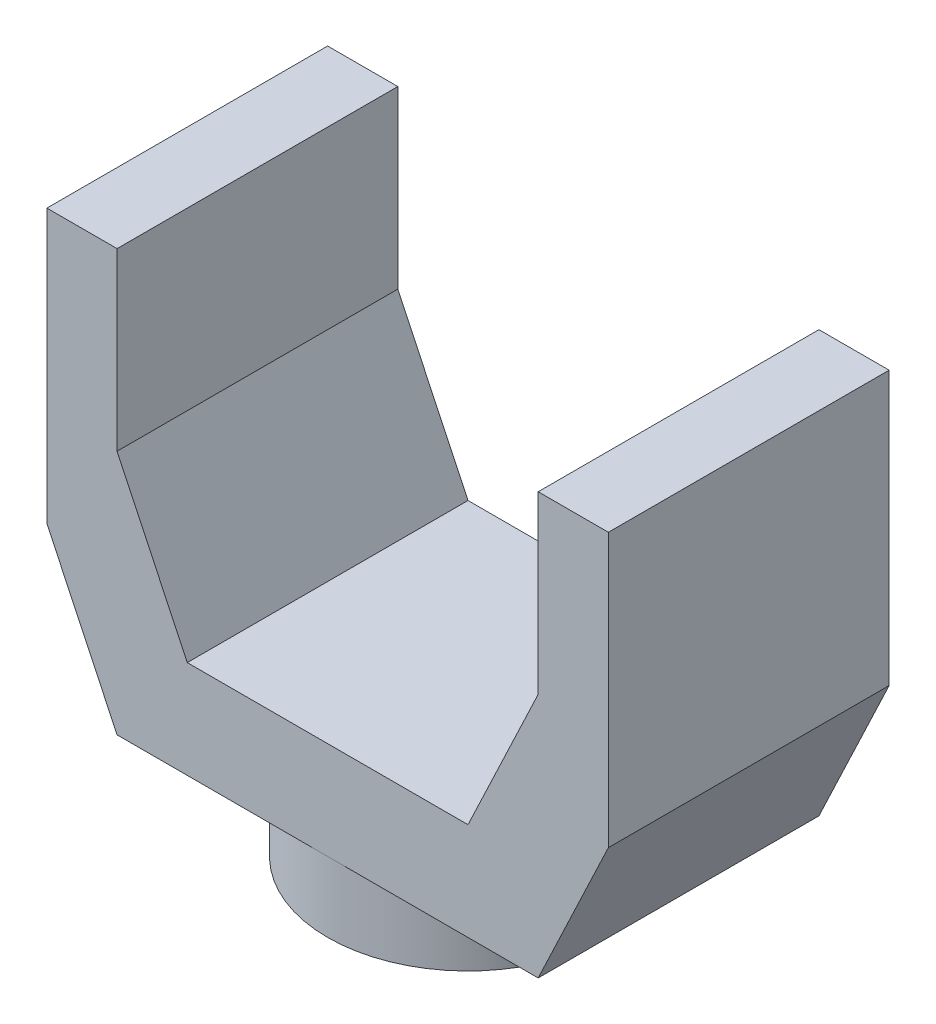
ISO-10303-21;
HEADER;
FILE_DESCRIPTION(('STEP AP214'),'2;1');
FILE_NAME('part.step','',(''),(''),'','','');
FILE_SCHEMA(('AUTOMOTIVE_DESIGN { 1 0 10303 214 1 1 1 1 }'));
ENDSEC;
DATA;
#1=APPLICATION_CONTEXT('core data for automotive mechanical design processes');
#2=APPLICATION_PROTOCOL_DEFINITION('international standard','automotive_design',2000,#1);
#3=PRODUCT_CONTEXT('',#1,'mechanical');
#4=PRODUCT('Part','Part','',(#3));
#5=PRODUCT_RELATED_PRODUCT_CATEGORY('part','',(#4));
#6=PRODUCT_DEFINITION_FORMATION('','',#4);
#7=PRODUCT_DEFINITION_CONTEXT('part definition',#1,'design');
#8=PRODUCT_DEFINITION('design','',#6,#7);
#9=PRODUCT_DEFINITION_SHAPE('','',#8);
#10=(LENGTH_UNIT() NAMED_UNIT(*) SI_UNIT(.MILLI.,.METRE.));
#11=(NAMED_UNIT(*) PLANE_ANGLE_UNIT() SI_UNIT($,.RADIAN.));
#12=(NAMED_UNIT(*) SI_UNIT($,.STERADIAN.) SOLID_ANGLE_UNIT());
#13=UNCERTAINTY_MEASURE_WITH_UNIT(LENGTH_MEASURE(1.E-05),#10,'distance_accuracy_value','');
#14=(GEOMETRIC_REPRESENTATION_CONTEXT(3) GLOBAL_UNCERTAINTY_ASSIGNED_CONTEXT((#13)) GLOBAL_UNIT_ASSIGNED_CONTEXT((#10,
#11,#12)) REPRESENTATION_CONTEXT('',''));
#15=CARTESIAN_POINT('',(0.,0.,0.));
#16=DIRECTION('',(0.,0.,1.));
#17=DIRECTION('',(1.,0.,0.));
#18=AXIS2_PLACEMENT_3D('',#15,#16,#17);
#19=CARTESIAN_POINT('',(-38.1,0.,25.4));
#20=DIRECTION('',(0.,1.,0.));
#21=DIRECTION('',(0.,0.,1.));
#22=AXIS2_PLACEMENT_3D('',#19,#20,#21);
#23=PLANE('',#22);
#24=CARTESIAN_POINT('',(0.,0.,0.));
#25=DIRECTION('',(0.,-1.,0.));
#26=DIRECTION('',(0.,0.,-1.));
#27=AXIS2_PLACEMENT_3D('',#24,#25,#26);
#28=CIRCLE('',#27,25.4);
#29=CARTESIAN_POINT('',(0.,0.,-25.4));
#30=VERTEX_POINT('',#29);
#31=CARTESIAN_POINT('',(0.,0.,25.4));
#32=VERTEX_POINT('',#31);
#33=EDGE_CURVE('E42',#30,#32,#28,.T.);
#34=ORIENTED_EDGE('',*,*,#33,.F.);
#35=DIRECTION('',(1.,0.,0.));
#36=VECTOR('',#35,1.);
#37=CARTESIAN_POINT('',(-38.1,0.,-25.4));
#38=LINE('',#37,#36);
#39=CARTESIAN_POINT('',(38.1,0.,-25.4));
#40=VERTEX_POINT('',#39);
#41=EDGE_CURVE('E101',#30,#40,#38,.T.);
#42=ORIENTED_EDGE('',*,*,#41,.T.);
#43=DIRECTION('',(0.,0.,-1.));
#44=VECTOR('',#43,1.);
#45=CARTESIAN_POINT('',(38.1,0.,25.4));
#46=LINE('',#45,#44);
#47=CARTESIAN_POINT('',(38.1,0.,25.4));
#48=VERTEX_POINT('',#47);
#49=EDGE_CURVE('E165',#48,#40,#46,.T.);
#50=ORIENTED_EDGE('',*,*,#49,.F.);
#51=DIRECTION('',(1.,0.,0.));
#52=VECTOR('',#51,1.);
#53=CARTESIAN_POINT('',(-38.1,0.,25.4));
#54=LINE('',#53,#52);
#55=EDGE_CURVE('E55',#32,#48,#54,.T.);
#56=ORIENTED_EDGE('',*,*,#55,.F.);
#57=EDGE_LOOP('',(#34,#42,#50,#56));
#58=FACE_BOUND('',#57,.T.);
#59=ADVANCED_FACE('F32',(#58),#23,.F.);
#60=CARTESIAN_POINT('',(38.1,0.,25.4));
#61=DIRECTION('',(-0.903507902905251,0.428571428571429,0.));
#62=DIRECTION('',(-0.428571428571429,-0.903507902905251,0.));
#63=AXIS2_PLACEMENT_3D('',#60,#61,#62);
#64=PLANE('',#63);
#65=DIRECTION('',(0.428571428571429,0.903507902905251,0.));
#66=VECTOR('',#65,1.);
#67=CARTESIAN_POINT('',(38.1,0.,-25.4));
#68=LINE('',#67,#66);
#69=CARTESIAN_POINT('',(50.8,26.7739508560923,-25.4));
#70=VERTEX_POINT('',#69);
#71=EDGE_CURVE('E166',#40,#70,#68,.T.);
#72=ORIENTED_EDGE('',*,*,#71,.T.);
#73=DIRECTION('',(0.,0.,-1.));
#74=VECTOR('',#73,1.);
#75=CARTESIAN_POINT('',(50.8,26.7739508560923,25.4));
#76=LINE('',#75,#74);
#77=CARTESIAN_POINT('',(50.8,26.7739508560923,25.4));
#78=VERTEX_POINT('',#77);
#79=EDGE_CURVE('E36',#78,#70,#76,.T.);
#80=ORIENTED_EDGE('',*,*,#79,.F.);
#81=DIRECTION('',(0.428571428571429,0.903507902905251,0.));
#82=VECTOR('',#81,1.);
#83=CARTESIAN_POINT('',(38.1,0.,25.4));
#84=LINE('',#83,#82);
#85=EDGE_CURVE('E191',#48,#78,#84,.T.);
#86=ORIENTED_EDGE('',*,*,#85,.F.);
#87=ORIENTED_EDGE('',*,*,#49,.T.);
#88=EDGE_LOOP('',(#72,#80,#86,#87));
#89=FACE_BOUND('',#88,.T.);
#90=ADVANCED_FACE('F34',(#89),#64,.F.);
#91=CARTESIAN_POINT('',(50.8,26.7739508560923,25.4));
#92=DIRECTION('',(-1.,0.,0.));
#93=DIRECTION('',(0.,0.,1.));
#94=AXIS2_PLACEMENT_3D('',#91,#92,#93);
#95=PLANE('',#94);
#96=DIRECTION('',(0.,1.,0.));
#97=VECTOR('',#96,1.);
#98=CARTESIAN_POINT('',(50.8,26.7739508560923,-25.4));
#99=LINE('',#98,#97);
#100=CARTESIAN_POINT('',(50.8,76.2,-25.4));
#101=VERTEX_POINT('',#100);
#102=EDGE_CURVE('E169',#70,#101,#99,.T.);
#103=ORIENTED_EDGE('',*,*,#102,.T.);
#104=DIRECTION('',(0.,0.,-1.));
#105=VECTOR('',#104,1.);
#106=CARTESIAN_POINT('',(50.8,76.2,25.4));
#107=LINE('',#106,#105);
#108=CARTESIAN_POINT('',(50.8,76.2,25.4));
#109=VERTEX_POINT('',#108);
#110=EDGE_CURVE('E212',#109,#101,#107,.T.);
#111=ORIENTED_EDGE('',*,*,#110,.F.);
#112=DIRECTION('',(0.,1.,0.));
#113=VECTOR('',#112,1.);
#114=CARTESIAN_POINT('',(50.8,26.7739508560923,25.4));
#115=LINE('',#114,#113);
#116=EDGE_CURVE('E110',#78,#109,#115,.T.);
#117=ORIENTED_EDGE('',*,*,#116,.F.);
#118=ORIENTED_EDGE('',*,*,#79,.T.);
#119=EDGE_LOOP('',(#103,#111,#117,#118));
#120=FACE_BOUND('',#119,.T.);
#121=ADVANCED_FACE('F218',(#120),#95,.F.);
#122=CARTESIAN_POINT('',(50.8,76.2,25.4));
#123=DIRECTION('',(0.,-1.,0.));
#124=DIRECTION('',(0.,0.,-1.));
#125=AXIS2_PLACEMENT_3D('',#122,#123,#124);
#126=PLANE('',#125);
#127=DIRECTION('',(-1.,0.,0.));
#128=VECTOR('',#127,1.);
#129=CARTESIAN_POINT('',(50.8,76.2,-25.4));
#130=LINE('',#129,#128);
#131=CARTESIAN_POINT('',(38.1,76.2,-25.4));
#132=VERTEX_POINT('',#131);
#133=EDGE_CURVE('E172',#101,#132,#130,.T.);
#134=ORIENTED_EDGE('',*,*,#133,.T.);
#135=DIRECTION('',(0.,0.,-1.));
#136=VECTOR('',#135,1.);
#137=CARTESIAN_POINT('',(38.1,76.2,25.4));
#138=LINE('',#137,#136);
#139=CARTESIAN_POINT('',(38.1,76.2,25.4));
#140=VERTEX_POINT('',#139);
#141=EDGE_CURVE('E210',#140,#132,#138,.T.);
#142=ORIENTED_EDGE('',*,*,#141,.F.);
#143=DIRECTION('',(-1.,0.,0.));
#144=VECTOR('',#143,1.);
#145=CARTESIAN_POINT('',(50.8,76.2,25.4));
#146=LINE('',#145,#144);
#147=EDGE_CURVE('E236',#109,#140,#146,.T.);
#148=ORIENTED_EDGE('',*,*,#147,.F.);
#149=ORIENTED_EDGE('',*,*,#110,.T.);
#150=EDGE_LOOP('',(#134,#142,#148,#149));
#151=FACE_BOUND('',#150,.T.);
#152=ADVANCED_FACE('F228',(#151),#126,.F.);
#153=CARTESIAN_POINT('',(38.1,76.2,25.4));
#154=DIRECTION('',(1.,0.,0.));
#155=DIRECTION('',(0.,0.,-1.));
#156=AXIS2_PLACEMENT_3D('',#153,#154,#155);
#157=PLANE('',#156);
#158=DIRECTION('',(0.,-1.,0.));
#159=VECTOR('',#158,1.);
#160=CARTESIAN_POINT('',(38.1,76.2,-25.4));
#161=LINE('',#160,#159);
#162=CARTESIAN_POINT('',(38.1,44.45,-25.4));
#163=VERTEX_POINT('',#162);
#164=EDGE_CURVE('E174',#132,#163,#161,.T.);
#165=ORIENTED_EDGE('',*,*,#164,.T.);
#166=DIRECTION('',(0.,0.,-1.));
#167=VECTOR('',#166,1.);
#168=CARTESIAN_POINT('',(38.1,44.45,25.4));
#169=LINE('',#168,#167);
#170=CARTESIAN_POINT('',(38.1,44.45,25.4));
#171=VERTEX_POINT('',#170);
#172=EDGE_CURVE('E207',#171,#163,#169,.T.);
#173=ORIENTED_EDGE('',*,*,#172,.F.);
#174=DIRECTION('',(0.,-1.,0.));
#175=VECTOR('',#174,1.);
#176=CARTESIAN_POINT('',(38.1,76.2,25.4));
#177=LINE('',#176,#175);
#178=EDGE_CURVE('E233',#140,#171,#177,.T.);
#179=ORIENTED_EDGE('',*,*,#178,.F.);
#180=ORIENTED_EDGE('',*,*,#141,.T.);
#181=EDGE_LOOP('',(#165,#173,#179,#180));
#182=FACE_BOUND('',#181,.T.);
#183=ADVANCED_FACE('F231',(#182),#157,.F.);
#184=CARTESIAN_POINT('',(38.1,44.45,25.4));
#185=DIRECTION('',(0.903507902905251,-0.428571428571428,0.));
#186=DIRECTION('',(0.428571428571428,0.903507902905251,0.));
#187=AXIS2_PLACEMENT_3D('',#184,#185,#186);
#188=PLANE('',#187);
#189=DIRECTION('',(-0.428571428571428,-0.903507902905251,0.));
#190=VECTOR('',#189,1.);
#191=CARTESIAN_POINT('',(38.1,44.45,-25.4));
#192=LINE('',#191,#190);
#193=CARTESIAN_POINT('',(25.4,17.6760491439077,-25.4));
#194=VERTEX_POINT('',#193);
#195=EDGE_CURVE('E176',#163,#194,#192,.T.);
#196=ORIENTED_EDGE('',*,*,#195,.T.);
#197=DIRECTION('',(0.,0.,-1.));
#198=VECTOR('',#197,1.);
#199=CARTESIAN_POINT('',(25.4,17.6760491439077,25.4));
#200=LINE('',#199,#198);
#201=CARTESIAN_POINT('',(25.4,17.6760491439077,25.4));
#202=VERTEX_POINT('',#201);
#203=EDGE_CURVE('E204',#202,#194,#200,.T.);
#204=ORIENTED_EDGE('',*,*,#203,.F.);
#205=DIRECTION('',(-0.428571428571428,-0.903507902905251,0.));
#206=VECTOR('',#205,1.);
#207=CARTESIAN_POINT('',(38.1,44.45,25.4));
#208=LINE('',#207,#206);
#209=EDGE_CURVE('E235',#171,#202,#208,.T.);
#210=ORIENTED_EDGE('',*,*,#209,.F.);
#211=ORIENTED_EDGE('',*,*,#172,.T.);
#212=EDGE_LOOP('',(#196,#204,#210,#211));
#213=FACE_BOUND('',#212,.T.);
#214=ADVANCED_FACE('F304',(#213),#188,.F.);
#215=CARTESIAN_POINT('',(25.4,17.6760491439077,25.4));
#216=DIRECTION('',(0.,-1.,0.));
#217=DIRECTION('',(0.,0.,-1.));
#218=AXIS2_PLACEMENT_3D('',#215,#216,#217);
#219=PLANE('',#218);
#220=DIRECTION('',(-1.,0.,0.));
#221=VECTOR('',#220,1.);
#222=CARTESIAN_POINT('',(25.4,17.6760491439077,-25.4));
#223=LINE('',#222,#221);
#224=CARTESIAN_POINT('',(-25.4,17.6760491439077,-25.4));
#225=VERTEX_POINT('',#224);
#226=EDGE_CURVE('E178',#194,#225,#223,.T.);
#227=ORIENTED_EDGE('',*,*,#226,.T.);
#228=DIRECTION('',(0.,0.,-1.));
#229=VECTOR('',#228,1.);
#230=CARTESIAN_POINT('',(-25.4,17.6760491439077,25.4));
#231=LINE('',#230,#229);
#232=CARTESIAN_POINT('',(-25.4,17.6760491439077,25.4));
#233=VERTEX_POINT('',#232);
#234=EDGE_CURVE('E201',#233,#225,#231,.T.);
#235=ORIENTED_EDGE('',*,*,#234,.F.);
#236=DIRECTION('',(-1.,0.,0.));
#237=VECTOR('',#236,1.);
#238=CARTESIAN_POINT('',(25.4,17.6760491439077,25.4));
#239=LINE('',#238,#237);
#240=EDGE_CURVE('E238',#202,#233,#239,.T.);
#241=ORIENTED_EDGE('',*,*,#240,.F.);
#242=ORIENTED_EDGE('',*,*,#203,.T.);
#243=EDGE_LOOP('',(#227,#235,#241,#242));
#244=FACE_BOUND('',#243,.T.);
#245=ADVANCED_FACE('F300',(#244),#219,.F.);
#246=CARTESIAN_POINT('',(-38.1,44.45,25.4));
#247=DIRECTION('',(-0.903507902905251,-0.428571428571428,0.));
#248=DIRECTION('',(0.428571428571428,-0.903507902905251,0.));
#249=AXIS2_PLACEMENT_3D('',#246,#247,#248);
#250=PLANE('',#249);
#251=DIRECTION('',(-0.428571428571428,0.903507902905251,0.));
#252=VECTOR('',#251,1.);
#253=CARTESIAN_POINT('',(-38.1,44.45,-25.4));
#254=LINE('',#253,#252);
#255=CARTESIAN_POINT('',(-38.1,44.45,-25.4));
#256=VERTEX_POINT('',#255);
#257=EDGE_CURVE('E180',#225,#256,#254,.T.);
#258=ORIENTED_EDGE('',*,*,#257,.T.);
#259=DIRECTION('',(0.,0.,-1.));
#260=VECTOR('',#259,1.);
#261=CARTESIAN_POINT('',(-38.1,44.45,25.4));
#262=LINE('',#261,#260);
#263=CARTESIAN_POINT('',(-38.1,44.45,25.4));
#264=VERTEX_POINT('',#263);
#265=EDGE_CURVE('E198',#264,#256,#262,.T.);
#266=ORIENTED_EDGE('',*,*,#265,.F.);
#267=DIRECTION('',(-0.428571428571428,0.903507902905251,0.));
#268=VECTOR('',#267,1.);
#269=CARTESIAN_POINT('',(-38.1,44.45,25.4));
#270=LINE('',#269,#268);
#271=EDGE_CURVE('E244',#233,#264,#270,.T.);
#272=ORIENTED_EDGE('',*,*,#271,.F.);
#273=ORIENTED_EDGE('',*,*,#234,.T.);
#274=EDGE_LOOP('',(#258,#266,#272,#273));
#275=FACE_BOUND('',#274,.T.);
#276=ADVANCED_FACE('F297',(#275),#250,.F.);
#277=CARTESIAN_POINT('',(-38.1,76.2,25.4));
#278=DIRECTION('',(-1.,0.,0.));
#279=DIRECTION('',(0.,0.,1.));
#280=AXIS2_PLACEMENT_3D('',#277,#278,#279);
#281=PLANE('',#280);
#282=DIRECTION('',(0.,1.,0.));
#283=VECTOR('',#282,1.);
#284=CARTESIAN_POINT('',(-38.1,76.2,-25.4));
#285=LINE('',#284,#283);
#286=CARTESIAN_POINT('',(-38.1,76.2,-25.4));
#287=VERTEX_POINT('',#286);
#288=EDGE_CURVE('E182',#256,#287,#285,.T.);
#289=ORIENTED_EDGE('',*,*,#288,.T.);
#290=DIRECTION('',(0.,0.,-1.));
#291=VECTOR('',#290,1.);
#292=CARTESIAN_POINT('',(-38.1,76.2,25.4));
#293=LINE('',#292,#291);
#294=CARTESIAN_POINT('',(-38.1,76.2,25.4));
#295=VERTEX_POINT('',#294);
#296=EDGE_CURVE('E195',#295,#287,#293,.T.);
#297=ORIENTED_EDGE('',*,*,#296,.F.);
#298=DIRECTION('',(0.,1.,0.));
#299=VECTOR('',#298,1.);
#300=CARTESIAN_POINT('',(-38.1,76.2,25.4));
#301=LINE('',#300,#299);
#302=EDGE_CURVE('E246',#264,#295,#301,.T.);
#303=ORIENTED_EDGE('',*,*,#302,.F.);
#304=ORIENTED_EDGE('',*,*,#265,.T.);
#305=EDGE_LOOP('',(#289,#297,#303,#304));
#306=FACE_BOUND('',#305,.T.);
#307=ADVANCED_FACE('F252',(#306),#281,.F.);
#308=CARTESIAN_POINT('',(-50.8,76.2,25.4));
#309=DIRECTION('',(0.,-1.,0.));
#310=DIRECTION('',(0.,0.,-1.));
#311=AXIS2_PLACEMENT_3D('',#308,#309,#310);
#312=PLANE('',#311);
#313=DIRECTION('',(-1.,0.,0.));
#314=VECTOR('',#313,1.);
#315=CARTESIAN_POINT('',(-50.8,76.2,-25.4));
#316=LINE('',#315,#314);
#317=CARTESIAN_POINT('',(-50.8,76.2,-25.4));
#318=VERTEX_POINT('',#317);
#319=EDGE_CURVE('E184',#287,#318,#316,.T.);
#320=ORIENTED_EDGE('',*,*,#319,.T.);
#321=DIRECTION('',(0.,0.,-1.));
#322=VECTOR('',#321,1.);
#323=CARTESIAN_POINT('',(-50.8,76.2,25.4));
#324=LINE('',#323,#322);
#325=CARTESIAN_POINT('',(-50.8,76.2,25.4));
#326=VERTEX_POINT('',#325);
#327=EDGE_CURVE('E155',#326,#318,#324,.T.);
#328=ORIENTED_EDGE('',*,*,#327,.F.);
#329=DIRECTION('',(-1.,0.,0.));
#330=VECTOR('',#329,1.);
#331=CARTESIAN_POINT('',(-50.8,76.2,25.4));
#332=LINE('',#331,#330);
#333=EDGE_CURVE('E143',#295,#326,#332,.T.);
#334=ORIENTED_EDGE('',*,*,#333,.F.);
#335=ORIENTED_EDGE('',*,*,#296,.T.);
#336=EDGE_LOOP('',(#320,#328,#334,#335));
#337=FACE_BOUND('',#336,.T.);
#338=ADVANCED_FACE('F256',(#337),#312,.F.);
#339=CARTESIAN_POINT('',(-50.8,26.7739508560923,25.4));
#340=DIRECTION('',(1.,0.,0.));
#341=DIRECTION('',(0.,0.,-1.));
#342=AXIS2_PLACEMENT_3D('',#339,#340,#341);
#343=PLANE('',#342);
#344=DIRECTION('',(0.,-1.,0.));
#345=VECTOR('',#344,1.);
#346=CARTESIAN_POINT('',(-50.8,26.7739508560923,-25.4));
#347=LINE('',#346,#345);
#348=CARTESIAN_POINT('',(-50.8,26.7739508560923,-25.4));
#349=VERTEX_POINT('',#348);
#350=EDGE_CURVE('E152',#318,#349,#347,.T.);
#351=ORIENTED_EDGE('',*,*,#350,.T.);
#352=DIRECTION('',(0.,0.,-1.));
#353=VECTOR('',#352,1.);
#354=CARTESIAN_POINT('',(-50.8,26.7739508560923,25.4));
#355=LINE('',#354,#353);
#356=CARTESIAN_POINT('',(-50.8,26.7739508560923,25.4));
#357=VERTEX_POINT('',#356);
#358=EDGE_CURVE('E149',#357,#349,#355,.T.);
#359=ORIENTED_EDGE('',*,*,#358,.F.);
#360=DIRECTION('',(0.,-1.,0.));
#361=VECTOR('',#360,1.);
#362=CARTESIAN_POINT('',(-50.8,26.7739508560923,25.4));
#363=LINE('',#362,#361);
#364=EDGE_CURVE('E136',#326,#357,#363,.T.);
#365=ORIENTED_EDGE('',*,*,#364,.F.);
#366=ORIENTED_EDGE('',*,*,#327,.T.);
#367=EDGE_LOOP('',(#351,#359,#365,#366));
#368=FACE_BOUND('',#367,.T.);
#369=ADVANCED_FACE('F150',(#368),#343,.F.);
#370=CARTESIAN_POINT('',(-38.1,0.,25.4));
#371=DIRECTION('',(0.903507902905251,0.428571428571429,0.));
#372=DIRECTION('',(-0.428571428571429,0.903507902905251,0.));
#373=AXIS2_PLACEMENT_3D('',#370,#371,#372);
#374=PLANE('',#373);
#375=DIRECTION('',(0.428571428571429,-0.903507902905251,0.));
#376=VECTOR('',#375,1.);
#377=CARTESIAN_POINT('',(-38.1,0.,-25.4));
#378=LINE('',#377,#376);
#379=CARTESIAN_POINT('',(-38.1,0.,-25.4));
#380=VERTEX_POINT('',#379);
#381=EDGE_CURVE('E187',#349,#380,#378,.T.);
#382=ORIENTED_EDGE('',*,*,#381,.T.);
#383=DIRECTION('',(0.,0.,-1.));
#384=VECTOR('',#383,1.);
#385=CARTESIAN_POINT('',(-38.1,0.,25.4));
#386=LINE('',#385,#384);
#387=CARTESIAN_POINT('',(-38.1,0.,25.4));
#388=VERTEX_POINT('',#387);
#389=EDGE_CURVE('E156',#388,#380,#386,.T.);
#390=ORIENTED_EDGE('',*,*,#389,.F.);
#391=DIRECTION('',(0.428571428571429,-0.903507902905251,0.));
#392=VECTOR('',#391,1.);
#393=CARTESIAN_POINT('',(-38.1,0.,25.4));
#394=LINE('',#393,#392);
#395=EDGE_CURVE('E140',#357,#388,#394,.T.);
#396=ORIENTED_EDGE('',*,*,#395,.F.);
#397=ORIENTED_EDGE('',*,*,#358,.T.);
#398=EDGE_LOOP('',(#382,#390,#396,#397));
#399=FACE_BOUND('',#398,.T.);
#400=ADVANCED_FACE('F158',(#399),#374,.F.);
#401=EDGE_CURVE('E11',#32,#30,#28,.T.);
#402=ORIENTED_EDGE('',*,*,#401,.F.);
#403=EDGE_CURVE('E161',#388,#32,#54,.T.);
#404=ORIENTED_EDGE('',*,*,#403,.F.);
#405=ORIENTED_EDGE('',*,*,#389,.T.);
#406=EDGE_CURVE('E189',#380,#30,#38,.T.);
#407=ORIENTED_EDGE('',*,*,#406,.T.);
#408=EDGE_LOOP('',(#402,#404,#405,#407));
#409=FACE_BOUND('',#408,.T.);
#410=ADVANCED_FACE('F257',(#409),#23,.F.);
#411=CARTESIAN_POINT('',(0.,0.,25.4));
#412=DIRECTION('',(0.,0.,1.));
#413=DIRECTION('',(1.,0.,0.));
#414=AXIS2_PLACEMENT_3D('',#411,#412,#413);
#415=PLANE('',#414);
#416=ORIENTED_EDGE('',*,*,#85,.T.);
#417=ORIENTED_EDGE('',*,*,#116,.T.);
#418=ORIENTED_EDGE('',*,*,#147,.T.);
#419=ORIENTED_EDGE('',*,*,#178,.T.);
#420=ORIENTED_EDGE('',*,*,#209,.T.);
#421=ORIENTED_EDGE('',*,*,#240,.T.);
#422=ORIENTED_EDGE('',*,*,#271,.T.);
#423=ORIENTED_EDGE('',*,*,#302,.T.);
#424=ORIENTED_EDGE('',*,*,#333,.T.);
#425=ORIENTED_EDGE('',*,*,#364,.T.);
#426=ORIENTED_EDGE('',*,*,#395,.T.);
#427=ORIENTED_EDGE('',*,*,#403,.T.);
#428=ORIENTED_EDGE('',*,*,#55,.T.);
#429=EDGE_LOOP('',(#416,#417,#418,#419,#420,#421,#422,#423,#424,#425,#426,#427,#428));
#430=FACE_BOUND('',#429,.T.);
#431=ADVANCED_FACE('F138',(#430),#415,.T.);
#432=CARTESIAN_POINT('',(0.,0.,-25.4));
#433=DIRECTION('',(0.,0.,1.));
#434=DIRECTION('',(1.,0.,0.));
#435=AXIS2_PLACEMENT_3D('',#432,#433,#434);
#436=PLANE('',#435);
#437=ORIENTED_EDGE('',*,*,#71,.F.);
#438=ORIENTED_EDGE('',*,*,#41,.F.);
#439=ORIENTED_EDGE('',*,*,#406,.F.);
#440=ORIENTED_EDGE('',*,*,#381,.F.);
#441=ORIENTED_EDGE('',*,*,#350,.F.);
#442=ORIENTED_EDGE('',*,*,#319,.F.);
#443=ORIENTED_EDGE('',*,*,#288,.F.);
#444=ORIENTED_EDGE('',*,*,#257,.F.);
#445=ORIENTED_EDGE('',*,*,#226,.F.);
#446=ORIENTED_EDGE('',*,*,#195,.F.);
#447=ORIENTED_EDGE('',*,*,#164,.F.);
#448=ORIENTED_EDGE('',*,*,#133,.F.);
#449=ORIENTED_EDGE('',*,*,#102,.F.);
#450=EDGE_LOOP('',(#437,#438,#439,#440,#441,#442,#443,#444,#445,#446,#447,#448,#449));
#451=FACE_BOUND('',#450,.T.);
#452=ADVANCED_FACE('F223',(#451),#436,.F.);
#453=CARTESIAN_POINT('',(0.,-12.7,0.));
#454=DIRECTION('',(0.,1.,0.));
#455=DIRECTION('',(0.,0.,1.));
#456=AXIS2_PLACEMENT_3D('',#453,#454,#455);
#457=CYLINDRICAL_SURFACE('',#456,25.4);
#458=CARTESIAN_POINT('',(0.,-12.7,0.));
#459=DIRECTION('',(0.,-1.,0.));
#460=DIRECTION('',(0.,0.,-1.));
#461=AXIS2_PLACEMENT_3D('',#458,#459,#460);
#462=CIRCLE('',#461,25.4);
#463=CARTESIAN_POINT('',(0.,-12.7,-25.4));
#464=VERTEX_POINT('',#463);
#465=EDGE_CURVE('E170',#464,#464,#462,.T.);
#466=ORIENTED_EDGE('',*,*,#465,.F.);
#467=EDGE_LOOP('',(#466));
#468=FACE_BOUND('',#467,.T.);
#469=ORIENTED_EDGE('',*,*,#33,.T.);
#470=ORIENTED_EDGE('',*,*,#401,.T.);
#471=EDGE_LOOP('',(#469,#470));
#472=FACE_BOUND('',#471,.T.);
#473=ADVANCED_FACE('F260',(#468,#472),#457,.T.);
#474=CARTESIAN_POINT('',(0.,-12.7,0.));
#475=DIRECTION('',(0.,-1.,0.));
#476=DIRECTION('',(0.,0.,-1.));
#477=AXIS2_PLACEMENT_3D('',#474,#475,#476);
#478=PLANE('',#477);
#479=ORIENTED_EDGE('',*,*,#465,.T.);
#480=EDGE_LOOP('',(#479));
#481=FACE_BOUND('',#480,.T.);
#482=ADVANCED_FACE('F266',(#481),#478,.T.);
#483=CLOSED_SHELL('',(#59,#90,#121,#152,#183,#214,#245,#276,#307,#338,#369,#400,#410,#431,#452,
#473,#482));
#484=MANIFOLD_SOLID_BREP('B2',#483);
#485=ADVANCED_BREP_SHAPE_REPRESENTATION('',(#18,#484),#14);
#486=SHAPE_DEFINITION_REPRESENTATION(#9,#485);
ENDSEC;
END-ISO-10303-21;
